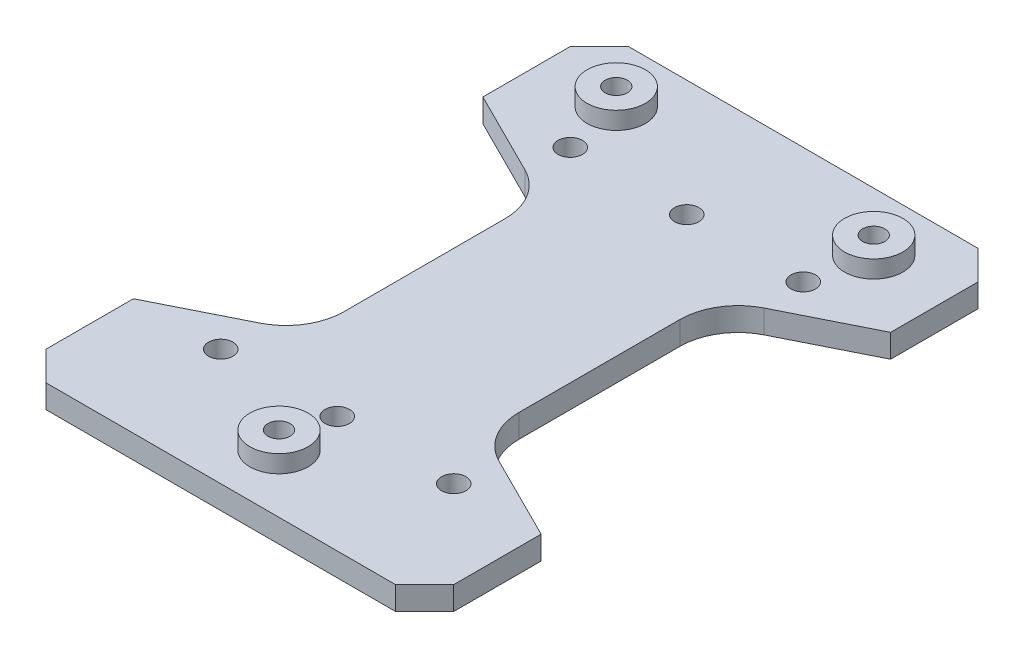
ISO-10303-21;
HEADER;
FILE_DESCRIPTION(('STEP AP214'),'2;1');
FILE_NAME('part.step','',(''),(''),'','','');
FILE_SCHEMA(('AUTOMOTIVE_DESIGN { 1 0 10303 214 1 1 1 1 }'));
ENDSEC;
DATA;
#1=APPLICATION_CONTEXT('core data for automotive mechanical design processes');
#2=APPLICATION_PROTOCOL_DEFINITION('international standard','automotive_design',2000,#1);
#3=PRODUCT_CONTEXT('',#1,'mechanical');
#4=PRODUCT('Part','Part','',(#3));
#5=PRODUCT_RELATED_PRODUCT_CATEGORY('part','',(#4));
#6=PRODUCT_DEFINITION_FORMATION('','',#4);
#7=PRODUCT_DEFINITION_CONTEXT('part definition',#1,'design');
#8=PRODUCT_DEFINITION('design','',#6,#7);
#9=PRODUCT_DEFINITION_SHAPE('','',#8);
#10=(LENGTH_UNIT() NAMED_UNIT(*) SI_UNIT(.MILLI.,.METRE.));
#11=(NAMED_UNIT(*) PLANE_ANGLE_UNIT() SI_UNIT($,.RADIAN.));
#12=(NAMED_UNIT(*) SI_UNIT($,.STERADIAN.) SOLID_ANGLE_UNIT());
#13=UNCERTAINTY_MEASURE_WITH_UNIT(LENGTH_MEASURE(1.E-05),#10,'distance_accuracy_value','');
#14=(GEOMETRIC_REPRESENTATION_CONTEXT(3) GLOBAL_UNCERTAINTY_ASSIGNED_CONTEXT((#13)) GLOBAL_UNIT_ASSIGNED_CONTEXT((#10,
#11,#12)) REPRESENTATION_CONTEXT('',''));
#15=CARTESIAN_POINT('',(0.,0.,0.));
#16=DIRECTION('',(0.,0.,1.));
#17=DIRECTION('',(1.,0.,0.));
#18=AXIS2_PLACEMENT_3D('',#15,#16,#17);
#19=CARTESIAN_POINT('',(35.,4.,-50.));
#20=DIRECTION('',(-1.,0.,0.));
#21=DIRECTION('',(0.,0.,1.));
#22=AXIS2_PLACEMENT_3D('',#19,#20,#21);
#23=PLANE('',#22);
#24=DIRECTION('',(0.,0.,-1.));
#25=VECTOR('',#24,1.);
#26=CARTESIAN_POINT('',(35.,4.,-50.));
#27=LINE('',#26,#25);
#28=CARTESIAN_POINT('',(35.,4.,45.));
#29=VERTEX_POINT('',#28);
#30=CARTESIAN_POINT('',(35.,4.,30.));
#31=VERTEX_POINT('',#30);
#32=EDGE_CURVE('E383',#29,#31,#27,.T.);
#33=ORIENTED_EDGE('',*,*,#32,.F.);
#34=DIRECTION('',(0.,-1.,0.));
#35=VECTOR('',#34,1.);
#36=CARTESIAN_POINT('',(35.,4.,45.));
#37=LINE('',#36,#35);
#38=CARTESIAN_POINT('',(35.,0.,45.));
#39=VERTEX_POINT('',#38);
#40=EDGE_CURVE('E267',#29,#39,#37,.T.);
#41=ORIENTED_EDGE('',*,*,#40,.T.);
#42=DIRECTION('',(0.,0.,-1.));
#43=VECTOR('',#42,1.);
#44=CARTESIAN_POINT('',(35.,0.,-50.));
#45=LINE('',#44,#43);
#46=CARTESIAN_POINT('',(35.,0.,30.));
#47=VERTEX_POINT('',#46);
#48=EDGE_CURVE('E198',#39,#47,#45,.T.);
#49=ORIENTED_EDGE('',*,*,#48,.T.);
#50=DIRECTION('',(0.,1.,0.));
#51=VECTOR('',#50,1.);
#52=CARTESIAN_POINT('',(35.,0.,30.));
#53=LINE('',#52,#51);
#54=EDGE_CURVE('E192',#47,#31,#53,.T.);
#55=ORIENTED_EDGE('',*,*,#54,.T.);
#56=EDGE_LOOP('',(#33,#41,#49,#55));
#57=FACE_BOUND('',#56,.T.);
#58=ADVANCED_FACE('F37',(#57),#23,.F.);
#59=CARTESIAN_POINT('',(35.,0.,-30.));
#60=VERTEX_POINT('',#59);
#61=CARTESIAN_POINT('',(35.,0.,-45.));
#62=VERTEX_POINT('',#61);
#63=EDGE_CURVE('E188',#60,#62,#45,.T.);
#64=ORIENTED_EDGE('',*,*,#63,.T.);
#65=DIRECTION('',(0.,1.,0.));
#66=VECTOR('',#65,1.);
#67=CARTESIAN_POINT('',(35.,4.,-45.));
#68=LINE('',#67,#66);
#69=CARTESIAN_POINT('',(35.,4.,-45.));
#70=VERTEX_POINT('',#69);
#71=EDGE_CURVE('E254',#62,#70,#68,.T.);
#72=ORIENTED_EDGE('',*,*,#71,.T.);
#73=CARTESIAN_POINT('',(35.,4.,-30.));
#74=VERTEX_POINT('',#73);
#75=EDGE_CURVE('E191',#74,#70,#27,.T.);
#76=ORIENTED_EDGE('',*,*,#75,.F.);
#77=DIRECTION('',(0.,1.,0.));
#78=VECTOR('',#77,1.);
#79=CARTESIAN_POINT('',(35.,0.,-30.));
#80=LINE('',#79,#78);
#81=EDGE_CURVE('E177',#60,#74,#80,.T.);
#82=ORIENTED_EDGE('',*,*,#81,.F.);
#83=EDGE_LOOP('',(#64,#72,#76,#82));
#84=FACE_BOUND('',#83,.T.);
#85=ADVANCED_FACE('F187',(#84),#23,.F.);
#86=CARTESIAN_POINT('',(0.,4.,0.));
#87=DIRECTION('',(0.,1.,0.));
#88=DIRECTION('',(0.,0.,1.));
#89=AXIS2_PLACEMENT_3D('',#86,#87,#88);
#90=PLANE('',#89);
#91=CARTESIAN_POINT('',(0.,4.,-30.));
#92=DIRECTION('',(0.,1.,0.));
#93=DIRECTION('',(0.,0.,1.));
#94=AXIS2_PLACEMENT_3D('',#91,#92,#93);
#95=CIRCLE('',#94,2.1);
#96=CARTESIAN_POINT('',(0.,4.,-27.9));
#97=VERTEX_POINT('',#96);
#98=EDGE_CURVE('E342',#97,#97,#95,.T.);
#99=ORIENTED_EDGE('',*,*,#98,.F.);
#100=EDGE_LOOP('',(#99));
#101=FACE_BOUND('',#100,.T.);
#102=CARTESIAN_POINT('',(-20.,4.,-30.));
#103=DIRECTION('',(0.,1.,0.));
#104=DIRECTION('',(0.,0.,1.));
#105=AXIS2_PLACEMENT_3D('',#102,#103,#104);
#106=CIRCLE('',#105,2.1);
#107=CARTESIAN_POINT('',(-20.,4.,-27.9));
#108=VERTEX_POINT('',#107);
#109=EDGE_CURVE('E345',#108,#108,#106,.T.);
#110=ORIENTED_EDGE('',*,*,#109,.F.);
#111=EDGE_LOOP('',(#110));
#112=FACE_BOUND('',#111,.T.);
#113=CARTESIAN_POINT('',(0.,4.,40.));
#114=DIRECTION('',(0.,1.,0.));
#115=DIRECTION('',(0.,0.,1.));
#116=AXIS2_PLACEMENT_3D('',#113,#114,#115);
#117=CIRCLE('',#116,5.);
#118=CARTESIAN_POINT('',(0.,4.,45.));
#119=VERTEX_POINT('',#118);
#120=EDGE_CURVE('E355',#119,#119,#117,.T.);
#121=ORIENTED_EDGE('',*,*,#120,.F.);
#122=EDGE_LOOP('',(#121));
#123=FACE_BOUND('',#122,.T.);
#124=CARTESIAN_POINT('',(22.1,4.,-40.));
#125=DIRECTION('',(0.,1.,0.));
#126=DIRECTION('',(0.,0.,1.));
#127=AXIS2_PLACEMENT_3D('',#124,#125,#126);
#128=CIRCLE('',#127,5.);
#129=CARTESIAN_POINT('',(22.1,4.,-35.));
#130=VERTEX_POINT('',#129);
#131=EDGE_CURVE('E373',#130,#130,#128,.T.);
#132=ORIENTED_EDGE('',*,*,#131,.F.);
#133=EDGE_LOOP('',(#132));
#134=FACE_BOUND('',#133,.T.);
#135=CARTESIAN_POINT('',(-22.1,4.,-40.));
#136=DIRECTION('',(0.,1.,0.));
#137=DIRECTION('',(0.,0.,1.));
#138=AXIS2_PLACEMENT_3D('',#135,#136,#137);
#139=CIRCLE('',#138,5.);
#140=CARTESIAN_POINT('',(-22.1,4.,-35.));
#141=VERTEX_POINT('',#140);
#142=EDGE_CURVE('E203',#141,#141,#139,.T.);
#143=ORIENTED_EDGE('',*,*,#142,.F.);
#144=EDGE_LOOP('',(#143));
#145=FACE_BOUND('',#144,.T.);
#146=CARTESIAN_POINT('',(20.,4.,-30.));
#147=DIRECTION('',(0.,1.,0.));
#148=DIRECTION('',(0.,0.,1.));
#149=AXIS2_PLACEMENT_3D('',#146,#147,#148);
#150=CIRCLE('',#149,2.1);
#151=CARTESIAN_POINT('',(20.,4.,-27.9));
#152=VERTEX_POINT('',#151);
#153=EDGE_CURVE('E221',#152,#152,#150,.T.);
#154=ORIENTED_EDGE('',*,*,#153,.F.);
#155=EDGE_LOOP('',(#154));
#156=FACE_BOUND('',#155,.T.);
#157=CARTESIAN_POINT('',(-20.,4.,30.));
#158=DIRECTION('',(0.,1.,0.));
#159=DIRECTION('',(0.,0.,1.));
#160=AXIS2_PLACEMENT_3D('',#157,#158,#159);
#161=CIRCLE('',#160,2.1);
#162=CARTESIAN_POINT('',(-20.,4.,32.1));
#163=VERTEX_POINT('',#162);
#164=EDGE_CURVE('E227',#163,#163,#161,.T.);
#165=ORIENTED_EDGE('',*,*,#164,.F.);
#166=EDGE_LOOP('',(#165));
#167=FACE_BOUND('',#166,.T.);
#168=CARTESIAN_POINT('',(0.,4.,30.));
#169=DIRECTION('',(0.,1.,0.));
#170=DIRECTION('',(0.,0.,1.));
#171=AXIS2_PLACEMENT_3D('',#168,#169,#170);
#172=CIRCLE('',#171,2.1);
#173=CARTESIAN_POINT('',(0.,4.,32.1));
#174=VERTEX_POINT('',#173);
#175=EDGE_CURVE('E233',#174,#174,#172,.T.);
#176=ORIENTED_EDGE('',*,*,#175,.F.);
#177=EDGE_LOOP('',(#176));
#178=FACE_BOUND('',#177,.T.);
#179=CARTESIAN_POINT('',(20.,4.,30.));
#180=DIRECTION('',(0.,1.,0.));
#181=DIRECTION('',(0.,0.,1.));
#182=AXIS2_PLACEMENT_3D('',#179,#180,#181);
#183=CIRCLE('',#182,2.1);
#184=CARTESIAN_POINT('',(20.,4.,32.1));
#185=VERTEX_POINT('',#184);
#186=EDGE_CURVE('E239',#185,#185,#183,.T.);
#187=ORIENTED_EDGE('',*,*,#186,.F.);
#188=EDGE_LOOP('',(#187));
#189=FACE_BOUND('',#188,.T.);
#190=ORIENTED_EDGE('',*,*,#75,.T.);
#191=DIRECTION('',(0.707106781186547,0.,0.707106781186549));
#192=VECTOR('',#191,1.);
#193=CARTESIAN_POINT('',(40.,4.,-39.9999999999999));
#194=LINE('',#193,#192);
#195=CARTESIAN_POINT('',(30.,4.,-50.));
#196=VERTEX_POINT('',#195);
#197=EDGE_CURVE('E262',#70,#196,#194,.F.);
#198=ORIENTED_EDGE('',*,*,#197,.T.);
#199=DIRECTION('',(-1.,0.,0.));
#200=VECTOR('',#199,1.);
#201=CARTESIAN_POINT('',(-35.,4.,-50.));
#202=LINE('',#201,#200);
#203=CARTESIAN_POINT('',(-30.,4.,-50.));
#204=VERTEX_POINT('',#203);
#205=EDGE_CURVE('E385',#196,#204,#202,.T.);
#206=ORIENTED_EDGE('',*,*,#205,.T.);
#207=DIRECTION('',(0.70710678118655,0.,-0.707106781186546));
#208=VECTOR('',#207,1.);
#209=CARTESIAN_POINT('',(-39.9999999999999,4.,-40.0000000000001));
#210=LINE('',#209,#208);
#211=CARTESIAN_POINT('',(-35.,4.,-45.));
#212=VERTEX_POINT('',#211);
#213=EDGE_CURVE('E260',#204,#212,#210,.F.);
#214=ORIENTED_EDGE('',*,*,#213,.T.);
#215=DIRECTION('',(0.,0.,1.));
#216=VECTOR('',#215,1.);
#217=CARTESIAN_POINT('',(-35.,4.,-50.));
#218=LINE('',#217,#216);
#219=CARTESIAN_POINT('',(-35.,4.,-30.));
#220=VERTEX_POINT('',#219);
#221=EDGE_CURVE('E388',#212,#220,#218,.T.);
#222=ORIENTED_EDGE('',*,*,#221,.T.);
#223=DIRECTION('',(-0.894427190999916,0.,-0.447213595499958));
#224=VECTOR('',#223,1.);
#225=CARTESIAN_POINT('',(5.,4.,-10.));
#226=LINE('',#225,#224);
#227=CARTESIAN_POINT('',(-20.5278640450004,4.,-22.7639320225002));
#228=VERTEX_POINT('',#227);
#229=EDGE_CURVE('E313',#228,#220,#226,.T.);
#230=ORIENTED_EDGE('',*,*,#229,.F.);
#231=CARTESIAN_POINT('',(-25.,4.,-13.819660112501));
#232=DIRECTION('',(0.,1.,0.));
#233=DIRECTION('',(0.,0.,1.));
#234=AXIS2_PLACEMENT_3D('',#231,#232,#233);
#235=CIRCLE('',#234,10.);
#236=CARTESIAN_POINT('',(-15.,4.,-13.819660112501));
#237=VERTEX_POINT('',#236);
#238=EDGE_CURVE('E45',#228,#237,#235,.F.);
#239=ORIENTED_EDGE('',*,*,#238,.T.);
#240=DIRECTION('',(0.,0.,-1.));
#241=VECTOR('',#240,1.);
#242=CARTESIAN_POINT('',(-15.,4.,0.));
#243=LINE('',#242,#241);
#244=CARTESIAN_POINT('',(-15.,4.,13.819660112501));
#245=VERTEX_POINT('',#244);
#246=EDGE_CURVE('E311',#245,#237,#243,.T.);
#247=ORIENTED_EDGE('',*,*,#246,.F.);
#248=CARTESIAN_POINT('',(-25.,4.,13.819660112501));
#249=DIRECTION('',(0.,1.,0.));
#250=DIRECTION('',(0.,0.,1.));
#251=AXIS2_PLACEMENT_3D('',#248,#249,#250);
#252=CIRCLE('',#251,10.);
#253=CARTESIAN_POINT('',(-20.5278640450004,4.,22.7639320225002));
#254=VERTEX_POINT('',#253);
#255=EDGE_CURVE('E303',#245,#254,#252,.F.);
#256=ORIENTED_EDGE('',*,*,#255,.T.);
#257=DIRECTION('',(0.894427190999916,0.,-0.447213595499958));
#258=VECTOR('',#257,1.);
#259=CARTESIAN_POINT('',(5.,4.,10.));
#260=LINE('',#259,#258);
#261=CARTESIAN_POINT('',(-35.,4.,30.));
#262=VERTEX_POINT('',#261);
#263=EDGE_CURVE('E318',#262,#254,#260,.T.);
#264=ORIENTED_EDGE('',*,*,#263,.F.);
#265=CARTESIAN_POINT('',(-35.,4.,45.));
#266=VERTEX_POINT('',#265);
#267=EDGE_CURVE('E387',#262,#266,#218,.T.);
#268=ORIENTED_EDGE('',*,*,#267,.T.);
#269=DIRECTION('',(-0.707106781186546,0.,-0.707106781186549));
#270=VECTOR('',#269,1.);
#271=CARTESIAN_POINT('',(-40.0000000000001,4.,39.9999999999999));
#272=LINE('',#271,#270);
#273=CARTESIAN_POINT('',(-30.,4.,50.));
#274=VERTEX_POINT('',#273);
#275=EDGE_CURVE('E256',#266,#274,#272,.F.);
#276=ORIENTED_EDGE('',*,*,#275,.T.);
#277=DIRECTION('',(1.,0.,0.));
#278=VECTOR('',#277,1.);
#279=CARTESIAN_POINT('',(-35.,4.,50.));
#280=LINE('',#279,#278);
#281=CARTESIAN_POINT('',(30.,4.,50.));
#282=VERTEX_POINT('',#281);
#283=EDGE_CURVE('E207',#274,#282,#280,.T.);
#284=ORIENTED_EDGE('',*,*,#283,.T.);
#285=DIRECTION('',(-0.707106781186549,0.,0.707106781186546));
#286=VECTOR('',#285,1.);
#287=CARTESIAN_POINT('',(39.9999999999999,4.,40.0000000000001));
#288=LINE('',#287,#286);
#289=EDGE_CURVE('E258',#282,#29,#288,.F.);
#290=ORIENTED_EDGE('',*,*,#289,.T.);
#291=ORIENTED_EDGE('',*,*,#32,.T.);
#292=DIRECTION('',(-0.894427190999916,0.,-0.447213595499958));
#293=VECTOR('',#292,1.);
#294=CARTESIAN_POINT('',(-5.,4.,10.));
#295=LINE('',#294,#293);
#296=CARTESIAN_POINT('',(20.5278640450004,4.,22.7639320225002));
#297=VERTEX_POINT('',#296);
#298=EDGE_CURVE('E420',#31,#297,#295,.T.);
#299=ORIENTED_EDGE('',*,*,#298,.T.);
#300=CARTESIAN_POINT('',(25.,4.,13.8196601125011));
#301=DIRECTION('',(0.,1.,0.));
#302=DIRECTION('',(0.,0.,1.));
#303=AXIS2_PLACEMENT_3D('',#300,#301,#302);
#304=CIRCLE('',#303,10.);
#305=CARTESIAN_POINT('',(15.,4.,13.8196601125011));
#306=VERTEX_POINT('',#305);
#307=EDGE_CURVE('E299',#297,#306,#304,.F.);
#308=ORIENTED_EDGE('',*,*,#307,.T.);
#309=DIRECTION('',(0.,0.,-1.));
#310=VECTOR('',#309,1.);
#311=CARTESIAN_POINT('',(15.,4.,0.));
#312=LINE('',#311,#310);
#313=CARTESIAN_POINT('',(15.,4.,-13.819660112501));
#314=VERTEX_POINT('',#313);
#315=EDGE_CURVE('E425',#306,#314,#312,.T.);
#316=ORIENTED_EDGE('',*,*,#315,.T.);
#317=CARTESIAN_POINT('',(25.,4.,-13.819660112501));
#318=DIRECTION('',(0.,1.,0.));
#319=DIRECTION('',(0.,0.,1.));
#320=AXIS2_PLACEMENT_3D('',#317,#318,#319);
#321=CIRCLE('',#320,10.);
#322=CARTESIAN_POINT('',(20.5278640450004,4.,-22.7639320225002));
#323=VERTEX_POINT('',#322);
#324=EDGE_CURVE('E295',#314,#323,#321,.F.);
#325=ORIENTED_EDGE('',*,*,#324,.T.);
#326=DIRECTION('',(0.894427190999916,0.,-0.447213595499958));
#327=VECTOR('',#326,1.);
#328=CARTESIAN_POINT('',(-5.,4.,-10.));
#329=LINE('',#328,#327);
#330=EDGE_CURVE('E429',#323,#74,#329,.T.);
#331=ORIENTED_EDGE('',*,*,#330,.T.);
#332=EDGE_LOOP('',(#190,#198,#206,#214,#222,#230,#239,#247,#256,#264,#268,#276,#284,#290,#291,
#299,#308,#316,#325,#331));
#333=FACE_BOUND('',#332,.T.);
#334=ADVANCED_FACE('F310',(#101,#112,#123,#134,#145,#156,#167,#178,#189,#333),#90,.T.);
#335=CARTESIAN_POINT('',(0.,0.,0.));
#336=DIRECTION('',(0.,1.,0.));
#337=DIRECTION('',(0.,0.,1.));
#338=AXIS2_PLACEMENT_3D('',#335,#336,#337);
#339=PLANE('',#338);
#340=CARTESIAN_POINT('',(20.,0.,30.));
#341=DIRECTION('',(0.,1.,0.));
#342=DIRECTION('',(0.,0.,1.));
#343=AXIS2_PLACEMENT_3D('',#340,#341,#342);
#344=CIRCLE('',#343,2.1);
#345=CARTESIAN_POINT('',(20.,0.,32.1));
#346=VERTEX_POINT('',#345);
#347=EDGE_CURVE('E236',#346,#346,#344,.T.);
#348=ORIENTED_EDGE('',*,*,#347,.T.);
#349=EDGE_LOOP('',(#348));
#350=FACE_BOUND('',#349,.T.);
#351=CARTESIAN_POINT('',(0.,0.,30.));
#352=DIRECTION('',(0.,1.,0.));
#353=DIRECTION('',(0.,0.,1.));
#354=AXIS2_PLACEMENT_3D('',#351,#352,#353);
#355=CIRCLE('',#354,2.1);
#356=CARTESIAN_POINT('',(0.,0.,32.1));
#357=VERTEX_POINT('',#356);
#358=EDGE_CURVE('E230',#357,#357,#355,.T.);
#359=ORIENTED_EDGE('',*,*,#358,.T.);
#360=EDGE_LOOP('',(#359));
#361=FACE_BOUND('',#360,.T.);
#362=CARTESIAN_POINT('',(-20.,0.,30.));
#363=DIRECTION('',(0.,1.,0.));
#364=DIRECTION('',(0.,0.,1.));
#365=AXIS2_PLACEMENT_3D('',#362,#363,#364);
#366=CIRCLE('',#365,2.1);
#367=CARTESIAN_POINT('',(-20.,0.,32.1));
#368=VERTEX_POINT('',#367);
#369=EDGE_CURVE('E224',#368,#368,#366,.T.);
#370=ORIENTED_EDGE('',*,*,#369,.T.);
#371=EDGE_LOOP('',(#370));
#372=FACE_BOUND('',#371,.T.);
#373=CARTESIAN_POINT('',(20.,0.,-30.));
#374=DIRECTION('',(0.,1.,0.));
#375=DIRECTION('',(0.,0.,1.));
#376=AXIS2_PLACEMENT_3D('',#373,#374,#375);
#377=CIRCLE('',#376,2.1);
#378=CARTESIAN_POINT('',(20.,0.,-27.9));
#379=VERTEX_POINT('',#378);
#380=EDGE_CURVE('E218',#379,#379,#377,.T.);
#381=ORIENTED_EDGE('',*,*,#380,.T.);
#382=EDGE_LOOP('',(#381));
#383=FACE_BOUND('',#382,.T.);
#384=CARTESIAN_POINT('',(-20.,0.,-30.));
#385=DIRECTION('',(0.,1.,0.));
#386=DIRECTION('',(0.,0.,1.));
#387=AXIS2_PLACEMENT_3D('',#384,#385,#386);
#388=CIRCLE('',#387,2.1);
#389=CARTESIAN_POINT('',(-20.,0.,-27.9));
#390=VERTEX_POINT('',#389);
#391=EDGE_CURVE('E346',#390,#390,#388,.T.);
#392=ORIENTED_EDGE('',*,*,#391,.T.);
#393=EDGE_LOOP('',(#392));
#394=FACE_BOUND('',#393,.T.);
#395=CARTESIAN_POINT('',(0.,0.,-30.));
#396=DIRECTION('',(0.,1.,0.));
#397=DIRECTION('',(0.,0.,1.));
#398=AXIS2_PLACEMENT_3D('',#395,#396,#397);
#399=CIRCLE('',#398,2.1);
#400=CARTESIAN_POINT('',(0.,0.,-27.9));
#401=VERTEX_POINT('',#400);
#402=EDGE_CURVE('E339',#401,#401,#399,.T.);
#403=ORIENTED_EDGE('',*,*,#402,.T.);
#404=EDGE_LOOP('',(#403));
#405=FACE_BOUND('',#404,.T.);
#406=DIRECTION('',(-1.,0.,0.));
#407=VECTOR('',#406,1.);
#408=CARTESIAN_POINT('',(-35.,0.,-50.));
#409=LINE('',#408,#407);
#410=CARTESIAN_POINT('',(30.,0.,-50.));
#411=VERTEX_POINT('',#410);
#412=CARTESIAN_POINT('',(-30.,0.,-50.));
#413=VERTEX_POINT('',#412);
#414=EDGE_CURVE('E201',#411,#413,#409,.T.);
#415=ORIENTED_EDGE('',*,*,#414,.F.);
#416=DIRECTION('',(-0.707106781186547,0.,-0.707106781186549));
#417=VECTOR('',#416,1.);
#418=CARTESIAN_POINT('',(30.,0.,-50.));
#419=LINE('',#418,#417);
#420=EDGE_CURVE('E197',#411,#62,#419,.F.);
#421=ORIENTED_EDGE('',*,*,#420,.T.);
#422=ORIENTED_EDGE('',*,*,#63,.F.);
#423=DIRECTION('',(0.894427190999916,0.,-0.447213595499958));
#424=VECTOR('',#423,1.);
#425=CARTESIAN_POINT('',(35.,0.,-30.));
#426=LINE('',#425,#424);
#427=CARTESIAN_POINT('',(20.5278640450004,0.,-22.7639320225002));
#428=VERTEX_POINT('',#427);
#429=EDGE_CURVE('E173',#428,#60,#426,.T.);
#430=ORIENTED_EDGE('',*,*,#429,.F.);
#431=CARTESIAN_POINT('',(25.,0.,-13.819660112501));
#432=DIRECTION('',(0.,1.,0.));
#433=DIRECTION('',(0.,0.,1.));
#434=AXIS2_PLACEMENT_3D('',#431,#432,#433);
#435=CIRCLE('',#434,10.);
#436=CARTESIAN_POINT('',(15.,0.,-13.819660112501));
#437=VERTEX_POINT('',#436);
#438=EDGE_CURVE('E297',#428,#437,#435,.T.);
#439=ORIENTED_EDGE('',*,*,#438,.T.);
#440=DIRECTION('',(0.,0.,-1.));
#441=VECTOR('',#440,1.);
#442=CARTESIAN_POINT('',(15.,0.,-20.));
#443=LINE('',#442,#441);
#444=CARTESIAN_POINT('',(15.,0.,13.8196601125011));
#445=VERTEX_POINT('',#444);
#446=EDGE_CURVE('E183',#445,#437,#443,.T.);
#447=ORIENTED_EDGE('',*,*,#446,.F.);
#448=CARTESIAN_POINT('',(25.,0.,13.8196601125011));
#449=DIRECTION('',(0.,1.,0.));
#450=DIRECTION('',(0.,0.,1.));
#451=AXIS2_PLACEMENT_3D('',#448,#449,#450);
#452=CIRCLE('',#451,10.);
#453=CARTESIAN_POINT('',(20.5278640450004,0.,22.7639320225002));
#454=VERTEX_POINT('',#453);
#455=EDGE_CURVE('E301',#445,#454,#452,.T.);
#456=ORIENTED_EDGE('',*,*,#455,.T.);
#457=DIRECTION('',(-0.894427190999916,0.,-0.447213595499958));
#458=VECTOR('',#457,1.);
#459=CARTESIAN_POINT('',(15.,0.,20.));
#460=LINE('',#459,#458);
#461=EDGE_CURVE('E193',#47,#454,#460,.T.);
#462=ORIENTED_EDGE('',*,*,#461,.F.);
#463=ORIENTED_EDGE('',*,*,#48,.F.);
#464=DIRECTION('',(0.707106781186549,0.,-0.707106781186546));
#465=VECTOR('',#464,1.);
#466=CARTESIAN_POINT('',(35.,0.,45.));
#467=LINE('',#466,#465);
#468=CARTESIAN_POINT('',(30.,0.,50.));
#469=VERTEX_POINT('',#468);
#470=EDGE_CURVE('E249',#39,#469,#467,.F.);
#471=ORIENTED_EDGE('',*,*,#470,.T.);
#472=DIRECTION('',(1.,0.,0.));
#473=VECTOR('',#472,1.);
#474=CARTESIAN_POINT('',(-35.,0.,50.));
#475=LINE('',#474,#473);
#476=CARTESIAN_POINT('',(-30.,0.,50.));
#477=VERTEX_POINT('',#476);
#478=EDGE_CURVE('E215',#477,#469,#475,.T.);
#479=ORIENTED_EDGE('',*,*,#478,.F.);
#480=DIRECTION('',(0.707106781186546,0.,0.707106781186549));
#481=VECTOR('',#480,1.);
#482=CARTESIAN_POINT('',(-30.,0.,50.));
#483=LINE('',#482,#481);
#484=CARTESIAN_POINT('',(-35.,0.,45.));
#485=VERTEX_POINT('',#484);
#486=EDGE_CURVE('E247',#477,#485,#483,.F.);
#487=ORIENTED_EDGE('',*,*,#486,.T.);
#488=DIRECTION('',(0.,0.,1.));
#489=VECTOR('',#488,1.);
#490=CARTESIAN_POINT('',(-35.,0.,-50.));
#491=LINE('',#490,#489);
#492=CARTESIAN_POINT('',(-35.,0.,30.));
#493=VERTEX_POINT('',#492);
#494=EDGE_CURVE('E211',#493,#485,#491,.T.);
#495=ORIENTED_EDGE('',*,*,#494,.F.);
#496=DIRECTION('',(0.894427190999916,0.,-0.447213595499958));
#497=VECTOR('',#496,1.);
#498=CARTESIAN_POINT('',(-15.,0.,20.));
#499=LINE('',#498,#497);
#500=CARTESIAN_POINT('',(-20.5278640450004,0.,22.7639320225002));
#501=VERTEX_POINT('',#500);
#502=EDGE_CURVE('E331',#493,#501,#499,.T.);
#503=ORIENTED_EDGE('',*,*,#502,.T.);
#504=CARTESIAN_POINT('',(-25.,0.,13.819660112501));
#505=DIRECTION('',(0.,1.,0.));
#506=DIRECTION('',(0.,0.,1.));
#507=AXIS2_PLACEMENT_3D('',#504,#505,#506);
#508=CIRCLE('',#507,10.);
#509=CARTESIAN_POINT('',(-15.,0.,13.819660112501));
#510=VERTEX_POINT('',#509);
#511=EDGE_CURVE('E305',#501,#510,#508,.T.);
#512=ORIENTED_EDGE('',*,*,#511,.T.);
#513=DIRECTION('',(0.,0.,-1.));
#514=VECTOR('',#513,1.);
#515=CARTESIAN_POINT('',(-15.,0.,-20.));
#516=LINE('',#515,#514);
#517=CARTESIAN_POINT('',(-15.,0.,-13.819660112501));
#518=VERTEX_POINT('',#517);
#519=EDGE_CURVE('E328',#510,#518,#516,.T.);
#520=ORIENTED_EDGE('',*,*,#519,.T.);
#521=CARTESIAN_POINT('',(-25.,0.,-13.819660112501));
#522=DIRECTION('',(0.,1.,0.));
#523=DIRECTION('',(0.,0.,1.));
#524=AXIS2_PLACEMENT_3D('',#521,#522,#523);
#525=CIRCLE('',#524,10.);
#526=CARTESIAN_POINT('',(-20.5278640450004,0.,-22.7639320225002));
#527=VERTEX_POINT('',#526);
#528=EDGE_CURVE('E11',#518,#527,#525,.T.);
#529=ORIENTED_EDGE('',*,*,#528,.T.);
#530=DIRECTION('',(-0.894427190999916,0.,-0.447213595499958));
#531=VECTOR('',#530,1.);
#532=CARTESIAN_POINT('',(-35.,0.,-30.));
#533=LINE('',#532,#531);
#534=CARTESIAN_POINT('',(-35.,0.,-30.));
#535=VERTEX_POINT('',#534);
#536=EDGE_CURVE('E323',#527,#535,#533,.T.);
#537=ORIENTED_EDGE('',*,*,#536,.T.);
#538=CARTESIAN_POINT('',(-35.,0.,-45.));
#539=VERTEX_POINT('',#538);
#540=EDGE_CURVE('E212',#539,#535,#491,.T.);
#541=ORIENTED_EDGE('',*,*,#540,.F.);
#542=DIRECTION('',(-0.70710678118655,0.,0.707106781186546));
#543=VECTOR('',#542,1.);
#544=CARTESIAN_POINT('',(-35.,0.,-45.));
#545=LINE('',#544,#543);
#546=EDGE_CURVE('E251',#539,#413,#545,.F.);
#547=ORIENTED_EDGE('',*,*,#546,.T.);
#548=EDGE_LOOP('',(#415,#421,#422,#430,#439,#447,#456,#462,#463,#471,#479,#487,#495,#503,#512,
#520,#529,#537,#541,#547));
#549=FACE_BOUND('',#548,.T.);
#550=ADVANCED_FACE('F196',(#350,#361,#372,#383,#394,#405,#549),#339,.F.);
#551=CARTESIAN_POINT('',(-35.,4.,-50.));
#552=DIRECTION('',(1.,0.,0.));
#553=DIRECTION('',(0.,0.,-1.));
#554=AXIS2_PLACEMENT_3D('',#551,#552,#553);
#555=PLANE('',#554);
#556=ORIENTED_EDGE('',*,*,#221,.F.);
#557=DIRECTION('',(0.,-1.,0.));
#558=VECTOR('',#557,1.);
#559=CARTESIAN_POINT('',(-35.,4.,-45.));
#560=LINE('',#559,#558);
#561=EDGE_CURVE('E264',#212,#539,#560,.T.);
#562=ORIENTED_EDGE('',*,*,#561,.T.);
#563=ORIENTED_EDGE('',*,*,#540,.T.);
#564=DIRECTION('',(0.,1.,0.));
#565=VECTOR('',#564,1.);
#566=CARTESIAN_POINT('',(-35.,0.,-30.));
#567=LINE('',#566,#565);
#568=EDGE_CURVE('E325',#535,#220,#567,.T.);
#569=ORIENTED_EDGE('',*,*,#568,.T.);
#570=EDGE_LOOP('',(#556,#562,#563,#569));
#571=FACE_BOUND('',#570,.T.);
#572=ADVANCED_FACE('F480',(#571),#555,.F.);
#573=CARTESIAN_POINT('',(20.,0.,30.));
#574=DIRECTION('',(0.,1.,0.));
#575=DIRECTION('',(0.,0.,1.));
#576=AXIS2_PLACEMENT_3D('',#573,#574,#575);
#577=CYLINDRICAL_SURFACE('',#576,2.1);
#578=ORIENTED_EDGE('',*,*,#347,.F.);
#579=EDGE_LOOP('',(#578));
#580=FACE_BOUND('',#579,.T.);
#581=ORIENTED_EDGE('',*,*,#186,.T.);
#582=EDGE_LOOP('',(#581));
#583=FACE_BOUND('',#582,.T.);
#584=ADVANCED_FACE('F476',(#580,#583),#577,.F.);
#585=CARTESIAN_POINT('',(0.,0.,30.));
#586=DIRECTION('',(0.,1.,0.));
#587=DIRECTION('',(0.,0.,1.));
#588=AXIS2_PLACEMENT_3D('',#585,#586,#587);
#589=CYLINDRICAL_SURFACE('',#588,2.1);
#590=ORIENTED_EDGE('',*,*,#358,.F.);
#591=EDGE_LOOP('',(#590));
#592=FACE_BOUND('',#591,.T.);
#593=ORIENTED_EDGE('',*,*,#175,.T.);
#594=EDGE_LOOP('',(#593));
#595=FACE_BOUND('',#594,.T.);
#596=ADVANCED_FACE('F472',(#592,#595),#589,.F.);
#597=CARTESIAN_POINT('',(-20.,0.,30.));
#598=DIRECTION('',(0.,1.,0.));
#599=DIRECTION('',(0.,0.,1.));
#600=AXIS2_PLACEMENT_3D('',#597,#598,#599);
#601=CYLINDRICAL_SURFACE('',#600,2.1);
#602=ORIENTED_EDGE('',*,*,#369,.F.);
#603=EDGE_LOOP('',(#602));
#604=FACE_BOUND('',#603,.T.);
#605=ORIENTED_EDGE('',*,*,#164,.T.);
#606=EDGE_LOOP('',(#605));
#607=FACE_BOUND('',#606,.T.);
#608=ADVANCED_FACE('F468',(#604,#607),#601,.F.);
#609=CARTESIAN_POINT('',(20.,0.,-30.));
#610=DIRECTION('',(0.,1.,0.));
#611=DIRECTION('',(0.,0.,1.));
#612=AXIS2_PLACEMENT_3D('',#609,#610,#611);
#613=CYLINDRICAL_SURFACE('',#612,2.1);
#614=ORIENTED_EDGE('',*,*,#380,.F.);
#615=EDGE_LOOP('',(#614));
#616=FACE_BOUND('',#615,.T.);
#617=ORIENTED_EDGE('',*,*,#153,.T.);
#618=EDGE_LOOP('',(#617));
#619=FACE_BOUND('',#618,.T.);
#620=ADVANCED_FACE('F465',(#616,#619),#613,.F.);
#621=CARTESIAN_POINT('',(-35.,4.,-50.));
#622=DIRECTION('',(0.,0.,1.));
#623=DIRECTION('',(1.,0.,0.));
#624=AXIS2_PLACEMENT_3D('',#621,#622,#623);
#625=PLANE('',#624);
#626=ORIENTED_EDGE('',*,*,#205,.F.);
#627=DIRECTION('',(0.,-1.,0.));
#628=VECTOR('',#627,1.);
#629=CARTESIAN_POINT('',(30.,4.,-50.));
#630=LINE('',#629,#628);
#631=EDGE_CURVE('E244',#196,#411,#630,.T.);
#632=ORIENTED_EDGE('',*,*,#631,.T.);
#633=ORIENTED_EDGE('',*,*,#414,.T.);
#634=DIRECTION('',(0.,1.,0.));
#635=VECTOR('',#634,1.);
#636=CARTESIAN_POINT('',(-30.,4.,-50.));
#637=LINE('',#636,#635);
#638=EDGE_CURVE('E242',#413,#204,#637,.T.);
#639=ORIENTED_EDGE('',*,*,#638,.T.);
#640=EDGE_LOOP('',(#626,#632,#633,#639));
#641=FACE_BOUND('',#640,.T.);
#642=ADVANCED_FACE('F463',(#641),#625,.F.);
#643=ORIENTED_EDGE('',*,*,#494,.T.);
#644=DIRECTION('',(0.,1.,0.));
#645=VECTOR('',#644,1.);
#646=CARTESIAN_POINT('',(-35.,4.,45.));
#647=LINE('',#646,#645);
#648=EDGE_CURVE('E275',#485,#266,#647,.T.);
#649=ORIENTED_EDGE('',*,*,#648,.T.);
#650=ORIENTED_EDGE('',*,*,#267,.F.);
#651=DIRECTION('',(0.,1.,0.));
#652=VECTOR('',#651,1.);
#653=CARTESIAN_POINT('',(-35.,0.,30.));
#654=LINE('',#653,#652);
#655=EDGE_CURVE('E327',#493,#262,#654,.T.);
#656=ORIENTED_EDGE('',*,*,#655,.F.);
#657=EDGE_LOOP('',(#643,#649,#650,#656));
#658=FACE_BOUND('',#657,.T.);
#659=ADVANCED_FACE('F608',(#658),#555,.F.);
#660=CARTESIAN_POINT('',(-35.,4.,50.));
#661=DIRECTION('',(0.,0.,-1.));
#662=DIRECTION('',(-1.,0.,0.));
#663=AXIS2_PLACEMENT_3D('',#660,#661,#662);
#664=PLANE('',#663);
#665=ORIENTED_EDGE('',*,*,#478,.T.);
#666=DIRECTION('',(0.,1.,0.));
#667=VECTOR('',#666,1.);
#668=CARTESIAN_POINT('',(30.,4.,50.));
#669=LINE('',#668,#667);
#670=EDGE_CURVE('E273',#469,#282,#669,.T.);
#671=ORIENTED_EDGE('',*,*,#670,.T.);
#672=ORIENTED_EDGE('',*,*,#283,.F.);
#673=DIRECTION('',(0.,-1.,0.));
#674=VECTOR('',#673,1.);
#675=CARTESIAN_POINT('',(-30.,4.,50.));
#676=LINE('',#675,#674);
#677=EDGE_CURVE('E270',#274,#477,#676,.T.);
#678=ORIENTED_EDGE('',*,*,#677,.T.);
#679=EDGE_LOOP('',(#665,#671,#672,#678));
#680=FACE_BOUND('',#679,.T.);
#681=ADVANCED_FACE('F404',(#680),#664,.F.);
#682=CARTESIAN_POINT('',(-22.1,7.,-40.));
#683=DIRECTION('',(0.,-1.,0.));
#684=DIRECTION('',(0.,0.,-1.));
#685=AXIS2_PLACEMENT_3D('',#682,#683,#684);
#686=CYLINDRICAL_SURFACE('',#685,5.);
#687=CARTESIAN_POINT('',(-22.1,7.,-40.));
#688=DIRECTION('',(0.,1.,0.));
#689=DIRECTION('',(0.,0.,1.));
#690=AXIS2_PLACEMENT_3D('',#687,#688,#689);
#691=CIRCLE('',#690,5.);
#692=CARTESIAN_POINT('',(-22.1,7.,-35.));
#693=VERTEX_POINT('',#692);
#694=EDGE_CURVE('E199',#693,#693,#691,.T.);
#695=ORIENTED_EDGE('',*,*,#694,.F.);
#696=EDGE_LOOP('',(#695));
#697=FACE_BOUND('',#696,.T.);
#698=ORIENTED_EDGE('',*,*,#142,.T.);
#699=EDGE_LOOP('',(#698));
#700=FACE_BOUND('',#699,.T.);
#701=ADVANCED_FACE('F632',(#697,#700),#686,.T.);
#702=CARTESIAN_POINT('',(-22.1,7.,-40.));
#703=DIRECTION('',(0.,1.,0.));
#704=DIRECTION('',(0.,0.,1.));
#705=AXIS2_PLACEMENT_3D('',#702,#703,#704);
#706=PLANE('',#705);
#707=CARTESIAN_POINT('',(-22.1,7.,-40.));
#708=DIRECTION('',(0.,1.,0.));
#709=DIRECTION('',(0.,0.,1.));
#710=AXIS2_PLACEMENT_3D('',#707,#708,#709);
#711=CIRCLE('',#710,1.9);
#712=CARTESIAN_POINT('',(-22.1,7.,-38.1));
#713=VERTEX_POINT('',#712);
#714=EDGE_CURVE('E356',#713,#713,#711,.T.);
#715=ORIENTED_EDGE('',*,*,#714,.F.);
#716=EDGE_LOOP('',(#715));
#717=FACE_BOUND('',#716,.T.);
#718=ORIENTED_EDGE('',*,*,#694,.T.);
#719=EDGE_LOOP('',(#718));
#720=FACE_BOUND('',#719,.T.);
#721=ADVANCED_FACE('F658',(#717,#720),#706,.T.);
#722=CARTESIAN_POINT('',(22.1,7.,-40.));
#723=DIRECTION('',(0.,-1.,0.));
#724=DIRECTION('',(0.,0.,-1.));
#725=AXIS2_PLACEMENT_3D('',#722,#723,#724);
#726=CYLINDRICAL_SURFACE('',#725,5.);
#727=CARTESIAN_POINT('',(22.1,7.,-40.));
#728=DIRECTION('',(0.,1.,0.));
#729=DIRECTION('',(0.,0.,1.));
#730=AXIS2_PLACEMENT_3D('',#727,#728,#729);
#731=CIRCLE('',#730,5.);
#732=CARTESIAN_POINT('',(22.1,7.,-35.));
#733=VERTEX_POINT('',#732);
#734=EDGE_CURVE('E376',#733,#733,#731,.T.);
#735=ORIENTED_EDGE('',*,*,#734,.F.);
#736=EDGE_LOOP('',(#735));
#737=FACE_BOUND('',#736,.T.);
#738=ORIENTED_EDGE('',*,*,#131,.T.);
#739=EDGE_LOOP('',(#738));
#740=FACE_BOUND('',#739,.T.);
#741=ADVANCED_FACE('F666',(#737,#740),#726,.T.);
#742=CARTESIAN_POINT('',(22.1,7.,-40.));
#743=DIRECTION('',(0.,1.,0.));
#744=DIRECTION('',(0.,0.,1.));
#745=AXIS2_PLACEMENT_3D('',#742,#743,#744);
#746=PLANE('',#745);
#747=CARTESIAN_POINT('',(22.1,7.,-40.));
#748=DIRECTION('',(0.,1.,0.));
#749=DIRECTION('',(0.,0.,1.));
#750=AXIS2_PLACEMENT_3D('',#747,#748,#749);
#751=CIRCLE('',#750,1.9);
#752=CARTESIAN_POINT('',(22.1,7.,-38.1));
#753=VERTEX_POINT('',#752);
#754=EDGE_CURVE('E362',#753,#753,#751,.T.);
#755=ORIENTED_EDGE('',*,*,#754,.F.);
#756=EDGE_LOOP('',(#755));
#757=FACE_BOUND('',#756,.T.);
#758=ORIENTED_EDGE('',*,*,#734,.T.);
#759=EDGE_LOOP('',(#758));
#760=FACE_BOUND('',#759,.T.);
#761=ADVANCED_FACE('F675',(#757,#760),#746,.T.);
#762=CARTESIAN_POINT('',(0.,7.,40.));
#763=DIRECTION('',(0.,-1.,0.));
#764=DIRECTION('',(0.,0.,-1.));
#765=AXIS2_PLACEMENT_3D('',#762,#763,#764);
#766=CYLINDRICAL_SURFACE('',#765,5.);
#767=CARTESIAN_POINT('',(0.,7.,40.));
#768=DIRECTION('',(0.,1.,0.));
#769=DIRECTION('',(0.,0.,1.));
#770=AXIS2_PLACEMENT_3D('',#767,#768,#769);
#771=CIRCLE('',#770,5.);
#772=CARTESIAN_POINT('',(0.,7.,45.));
#773=VERTEX_POINT('',#772);
#774=EDGE_CURVE('E370',#773,#773,#771,.T.);
#775=ORIENTED_EDGE('',*,*,#774,.F.);
#776=EDGE_LOOP('',(#775));
#777=FACE_BOUND('',#776,.T.);
#778=ORIENTED_EDGE('',*,*,#120,.T.);
#779=EDGE_LOOP('',(#778));
#780=FACE_BOUND('',#779,.T.);
#781=ADVANCED_FACE('F682',(#777,#780),#766,.T.);
#782=CARTESIAN_POINT('',(0.,7.,40.));
#783=DIRECTION('',(0.,1.,0.));
#784=DIRECTION('',(0.,0.,1.));
#785=AXIS2_PLACEMENT_3D('',#782,#783,#784);
#786=PLANE('',#785);
#787=CARTESIAN_POINT('',(0.,7.,40.));
#788=DIRECTION('',(0.,1.,0.));
#789=DIRECTION('',(0.,0.,1.));
#790=AXIS2_PLACEMENT_3D('',#787,#788,#789);
#791=CIRCLE('',#790,1.9);
#792=CARTESIAN_POINT('',(0.,7.,41.9));
#793=VERTEX_POINT('',#792);
#794=EDGE_CURVE('E349',#793,#793,#791,.T.);
#795=ORIENTED_EDGE('',*,*,#794,.F.);
#796=EDGE_LOOP('',(#795));
#797=FACE_BOUND('',#796,.T.);
#798=ORIENTED_EDGE('',*,*,#774,.T.);
#799=EDGE_LOOP('',(#798));
#800=FACE_BOUND('',#799,.T.);
#801=ADVANCED_FACE('F690',(#797,#800),#786,.T.);
#802=CARTESIAN_POINT('',(0.,3.,40.));
#803=DIRECTION('',(0.,1.,0.));
#804=DIRECTION('',(0.,0.,1.));
#805=AXIS2_PLACEMENT_3D('',#802,#803,#804);
#806=CYLINDRICAL_SURFACE('',#805,1.9);
#807=CARTESIAN_POINT('',(0.,3.,40.));
#808=DIRECTION('',(0.,1.,0.));
#809=DIRECTION('',(0.,0.,1.));
#810=AXIS2_PLACEMENT_3D('',#807,#808,#809);
#811=CIRCLE('',#810,1.9);
#812=CARTESIAN_POINT('',(0.,3.,41.9));
#813=VERTEX_POINT('',#812);
#814=EDGE_CURVE('E365',#813,#813,#811,.T.);
#815=ORIENTED_EDGE('',*,*,#814,.F.);
#816=EDGE_LOOP('',(#815));
#817=FACE_BOUND('',#816,.T.);
#818=ORIENTED_EDGE('',*,*,#794,.T.);
#819=EDGE_LOOP('',(#818));
#820=FACE_BOUND('',#819,.T.);
#821=ADVANCED_FACE('F697',(#817,#820),#806,.F.);
#822=CARTESIAN_POINT('',(0.,3.,40.));
#823=DIRECTION('',(0.,1.,0.));
#824=DIRECTION('',(0.,0.,1.));
#825=AXIS2_PLACEMENT_3D('',#822,#823,#824);
#826=PLANE('',#825);
#827=ORIENTED_EDGE('',*,*,#814,.T.);
#828=EDGE_LOOP('',(#827));
#829=FACE_BOUND('',#828,.T.);
#830=ADVANCED_FACE('F705',(#829),#826,.T.);
#831=CARTESIAN_POINT('',(22.1,3.,-40.));
#832=DIRECTION('',(0.,1.,0.));
#833=DIRECTION('',(0.,0.,1.));
#834=AXIS2_PLACEMENT_3D('',#831,#832,#833);
#835=CYLINDRICAL_SURFACE('',#834,1.9);
#836=CARTESIAN_POINT('',(22.1,3.,-40.));
#837=DIRECTION('',(0.,1.,0.));
#838=DIRECTION('',(0.,0.,1.));
#839=AXIS2_PLACEMENT_3D('',#836,#837,#838);
#840=CIRCLE('',#839,1.9);
#841=CARTESIAN_POINT('',(22.1,3.,-38.1));
#842=VERTEX_POINT('',#841);
#843=EDGE_CURVE('E359',#842,#842,#840,.T.);
#844=ORIENTED_EDGE('',*,*,#843,.F.);
#845=EDGE_LOOP('',(#844));
#846=FACE_BOUND('',#845,.T.);
#847=ORIENTED_EDGE('',*,*,#754,.T.);
#848=EDGE_LOOP('',(#847));
#849=FACE_BOUND('',#848,.T.);
#850=ADVANCED_FACE('F713',(#846,#849),#835,.F.);
#851=CARTESIAN_POINT('',(22.1,3.,-40.));
#852=DIRECTION('',(0.,1.,0.));
#853=DIRECTION('',(0.,0.,1.));
#854=AXIS2_PLACEMENT_3D('',#851,#852,#853);
#855=PLANE('',#854);
#856=ORIENTED_EDGE('',*,*,#843,.T.);
#857=EDGE_LOOP('',(#856));
#858=FACE_BOUND('',#857,.T.);
#859=ADVANCED_FACE('F721',(#858),#855,.T.);
#860=CARTESIAN_POINT('',(-22.1,3.,-40.));
#861=DIRECTION('',(0.,1.,0.));
#862=DIRECTION('',(0.,0.,1.));
#863=AXIS2_PLACEMENT_3D('',#860,#861,#862);
#864=CYLINDRICAL_SURFACE('',#863,1.9);
#865=CARTESIAN_POINT('',(-22.1,3.,-40.));
#866=DIRECTION('',(0.,1.,0.));
#867=DIRECTION('',(0.,0.,1.));
#868=AXIS2_PLACEMENT_3D('',#865,#866,#867);
#869=CIRCLE('',#868,1.9);
#870=CARTESIAN_POINT('',(-22.1,3.,-38.1));
#871=VERTEX_POINT('',#870);
#872=EDGE_CURVE('E352',#871,#871,#869,.T.);
#873=ORIENTED_EDGE('',*,*,#872,.F.);
#874=EDGE_LOOP('',(#873));
#875=FACE_BOUND('',#874,.T.);
#876=ORIENTED_EDGE('',*,*,#714,.T.);
#877=EDGE_LOOP('',(#876));
#878=FACE_BOUND('',#877,.T.);
#879=ADVANCED_FACE('F729',(#875,#878),#864,.F.);
#880=CARTESIAN_POINT('',(-22.1,3.,-40.));
#881=DIRECTION('',(0.,1.,0.));
#882=DIRECTION('',(0.,0.,1.));
#883=AXIS2_PLACEMENT_3D('',#880,#881,#882);
#884=PLANE('',#883);
#885=ORIENTED_EDGE('',*,*,#872,.T.);
#886=EDGE_LOOP('',(#885));
#887=FACE_BOUND('',#886,.T.);
#888=ADVANCED_FACE('F737',(#887),#884,.T.);
#889=CARTESIAN_POINT('',(-20.,0.,-30.));
#890=DIRECTION('',(0.,1.,0.));
#891=DIRECTION('',(0.,0.,1.));
#892=AXIS2_PLACEMENT_3D('',#889,#890,#891);
#893=CYLINDRICAL_SURFACE('',#892,2.1);
#894=ORIENTED_EDGE('',*,*,#391,.F.);
#895=EDGE_LOOP('',(#894));
#896=FACE_BOUND('',#895,.T.);
#897=ORIENTED_EDGE('',*,*,#109,.T.);
#898=EDGE_LOOP('',(#897));
#899=FACE_BOUND('',#898,.T.);
#900=ADVANCED_FACE('F745',(#896,#899),#893,.F.);
#901=CARTESIAN_POINT('',(0.,0.,-30.));
#902=DIRECTION('',(0.,1.,0.));
#903=DIRECTION('',(0.,0.,1.));
#904=AXIS2_PLACEMENT_3D('',#901,#902,#903);
#905=CYLINDRICAL_SURFACE('',#904,2.1);
#906=ORIENTED_EDGE('',*,*,#402,.F.);
#907=EDGE_LOOP('',(#906));
#908=FACE_BOUND('',#907,.T.);
#909=ORIENTED_EDGE('',*,*,#98,.T.);
#910=EDGE_LOOP('',(#909));
#911=FACE_BOUND('',#910,.T.);
#912=ADVANCED_FACE('F573',(#908,#911),#905,.F.);
#913=CARTESIAN_POINT('',(-35.,0.,-30.));
#914=DIRECTION('',(0.447213595499958,0.,-0.894427190999916));
#915=DIRECTION('',(-0.894427190999916,0.,-0.447213595499958));
#916=AXIS2_PLACEMENT_3D('',#913,#914,#915);
#917=PLANE('',#916);
#918=ORIENTED_EDGE('',*,*,#536,.F.);
#919=DIRECTION('',(0.,1.,0.));
#920=VECTOR('',#919,1.);
#921=CARTESIAN_POINT('',(-20.5278640450004,4.,-22.7639320225002));
#922=LINE('',#921,#920);
#923=EDGE_CURVE('E293',#527,#228,#922,.T.);
#924=ORIENTED_EDGE('',*,*,#923,.T.);
#925=ORIENTED_EDGE('',*,*,#229,.T.);
#926=ORIENTED_EDGE('',*,*,#568,.F.);
#927=EDGE_LOOP('',(#918,#924,#925,#926));
#928=FACE_BOUND('',#927,.T.);
#929=ADVANCED_FACE('F321',(#928),#917,.F.);
#930=CARTESIAN_POINT('',(-15.,0.,-20.));
#931=DIRECTION('',(1.,0.,0.));
#932=DIRECTION('',(0.,0.,-1.));
#933=AXIS2_PLACEMENT_3D('',#930,#931,#932);
#934=PLANE('',#933);
#935=ORIENTED_EDGE('',*,*,#519,.F.);
#936=DIRECTION('',(0.,1.,0.));
#937=VECTOR('',#936,1.);
#938=CARTESIAN_POINT('',(-15.,4.,13.819660112501));
#939=LINE('',#938,#937);
#940=EDGE_CURVE('E288',#510,#245,#939,.T.);
#941=ORIENTED_EDGE('',*,*,#940,.T.);
#942=ORIENTED_EDGE('',*,*,#246,.T.);
#943=DIRECTION('',(0.,1.,0.));
#944=VECTOR('',#943,1.);
#945=CARTESIAN_POINT('',(-15.,0.,-13.819660112501));
#946=LINE('',#945,#944);
#947=EDGE_CURVE('E286',#237,#518,#946,.F.);
#948=ORIENTED_EDGE('',*,*,#947,.T.);
#949=EDGE_LOOP('',(#935,#941,#942,#948));
#950=FACE_BOUND('',#949,.T.);
#951=ADVANCED_FACE('F316',(#950),#934,.F.);
#952=CARTESIAN_POINT('',(-15.,0.,20.));
#953=DIRECTION('',(0.447213595499958,0.,0.894427190999916));
#954=DIRECTION('',(0.894427190999916,0.,-0.447213595499958));
#955=AXIS2_PLACEMENT_3D('',#952,#953,#954);
#956=PLANE('',#955);
#957=ORIENTED_EDGE('',*,*,#263,.T.);
#958=DIRECTION('',(0.,1.,0.));
#959=VECTOR('',#958,1.);
#960=CARTESIAN_POINT('',(-20.5278640450004,0.,22.7639320225002));
#961=LINE('',#960,#959);
#962=EDGE_CURVE('E291',#254,#501,#961,.F.);
#963=ORIENTED_EDGE('',*,*,#962,.T.);
#964=ORIENTED_EDGE('',*,*,#502,.F.);
#965=ORIENTED_EDGE('',*,*,#655,.T.);
#966=EDGE_LOOP('',(#957,#963,#964,#965));
#967=FACE_BOUND('',#966,.T.);
#968=ADVANCED_FACE('F545',(#967),#956,.F.);
#969=CARTESIAN_POINT('',(15.,0.,20.));
#970=DIRECTION('',(0.447213595499958,0.,-0.894427190999916));
#971=DIRECTION('',(-0.894427190999916,0.,-0.447213595499958));
#972=AXIS2_PLACEMENT_3D('',#969,#970,#971);
#973=PLANE('',#972);
#974=ORIENTED_EDGE('',*,*,#461,.T.);
#975=DIRECTION('',(0.,1.,0.));
#976=VECTOR('',#975,1.);
#977=CARTESIAN_POINT('',(20.5278640450004,4.,22.7639320225002));
#978=LINE('',#977,#976);
#979=EDGE_CURVE('E283',#454,#297,#978,.T.);
#980=ORIENTED_EDGE('',*,*,#979,.T.);
#981=ORIENTED_EDGE('',*,*,#298,.F.);
#982=ORIENTED_EDGE('',*,*,#54,.F.);
#983=EDGE_LOOP('',(#974,#980,#981,#982));
#984=FACE_BOUND('',#983,.T.);
#985=ADVANCED_FACE('F423',(#984),#973,.T.);
#986=CARTESIAN_POINT('',(15.,0.,-20.));
#987=DIRECTION('',(1.,0.,0.));
#988=DIRECTION('',(0.,0.,-1.));
#989=AXIS2_PLACEMENT_3D('',#986,#987,#988);
#990=PLANE('',#989);
#991=ORIENTED_EDGE('',*,*,#446,.T.);
#992=DIRECTION('',(0.,1.,0.));
#993=VECTOR('',#992,1.);
#994=CARTESIAN_POINT('',(15.,4.,-13.819660112501));
#995=LINE('',#994,#993);
#996=EDGE_CURVE('E279',#437,#314,#995,.T.);
#997=ORIENTED_EDGE('',*,*,#996,.T.);
#998=ORIENTED_EDGE('',*,*,#315,.F.);
#999=DIRECTION('',(0.,1.,0.));
#1000=VECTOR('',#999,1.);
#1001=CARTESIAN_POINT('',(15.,0.,13.8196601125011));
#1002=LINE('',#1001,#1000);
#1003=EDGE_CURVE('E277',#306,#445,#1002,.F.);
#1004=ORIENTED_EDGE('',*,*,#1003,.T.);
#1005=EDGE_LOOP('',(#991,#997,#998,#1004));
#1006=FACE_BOUND('',#1005,.T.);
#1007=ADVANCED_FACE('F439',(#1006),#990,.T.);
#1008=CARTESIAN_POINT('',(35.,0.,-30.));
#1009=DIRECTION('',(0.447213595499958,0.,0.894427190999916));
#1010=DIRECTION('',(0.894427190999916,0.,-0.447213595499958));
#1011=AXIS2_PLACEMENT_3D('',#1008,#1009,#1010);
#1012=PLANE('',#1011);
#1013=ORIENTED_EDGE('',*,*,#330,.F.);
#1014=DIRECTION('',(0.,1.,0.));
#1015=VECTOR('',#1014,1.);
#1016=CARTESIAN_POINT('',(20.5278640450004,0.,-22.7639320225002));
#1017=LINE('',#1016,#1015);
#1018=EDGE_CURVE('E180',#323,#428,#1017,.F.);
#1019=ORIENTED_EDGE('',*,*,#1018,.T.);
#1020=ORIENTED_EDGE('',*,*,#429,.T.);
#1021=ORIENTED_EDGE('',*,*,#81,.T.);
#1022=EDGE_LOOP('',(#1013,#1019,#1020,#1021));
#1023=FACE_BOUND('',#1022,.T.);
#1024=ADVANCED_FACE('F176',(#1023),#1012,.T.);
#1025=CARTESIAN_POINT('',(30.,4.,-50.));
#1026=DIRECTION('',(-0.707106781186548,0.,0.707106781186546));
#1027=DIRECTION('',(0.,-1.,0.));
#1028=AXIS2_PLACEMENT_3D('',#1025,#1026,#1027);
#1029=PLANE('',#1028);
#1030=ORIENTED_EDGE('',*,*,#197,.F.);
#1031=ORIENTED_EDGE('',*,*,#71,.F.);
#1032=ORIENTED_EDGE('',*,*,#420,.F.);
#1033=ORIENTED_EDGE('',*,*,#631,.F.);
#1034=EDGE_LOOP('',(#1030,#1031,#1032,#1033));
#1035=FACE_BOUND('',#1034,.T.);
#1036=ADVANCED_FACE('F482',(#1035),#1029,.F.);
#1037=CARTESIAN_POINT('',(-35.,4.,-45.));
#1038=DIRECTION('',(0.707106781186545,0.,0.707106781186549));
#1039=DIRECTION('',(0.,-1.,0.));
#1040=AXIS2_PLACEMENT_3D('',#1037,#1038,#1039);
#1041=PLANE('',#1040);
#1042=ORIENTED_EDGE('',*,*,#213,.F.);
#1043=ORIENTED_EDGE('',*,*,#638,.F.);
#1044=ORIENTED_EDGE('',*,*,#546,.F.);
#1045=ORIENTED_EDGE('',*,*,#561,.F.);
#1046=EDGE_LOOP('',(#1042,#1043,#1044,#1045));
#1047=FACE_BOUND('',#1046,.T.);
#1048=ADVANCED_FACE('F485',(#1047),#1041,.F.);
#1049=CARTESIAN_POINT('',(35.,4.,45.));
#1050=DIRECTION('',(-0.707106781186545,0.,-0.707106781186549));
#1051=DIRECTION('',(0.,-1.,0.));
#1052=AXIS2_PLACEMENT_3D('',#1049,#1050,#1051);
#1053=PLANE('',#1052);
#1054=ORIENTED_EDGE('',*,*,#289,.F.);
#1055=ORIENTED_EDGE('',*,*,#670,.F.);
#1056=ORIENTED_EDGE('',*,*,#470,.F.);
#1057=ORIENTED_EDGE('',*,*,#40,.F.);
#1058=EDGE_LOOP('',(#1054,#1055,#1056,#1057));
#1059=FACE_BOUND('',#1058,.T.);
#1060=ADVANCED_FACE('F413',(#1059),#1053,.F.);
#1061=CARTESIAN_POINT('',(-30.,4.,50.));
#1062=DIRECTION('',(0.707106781186549,0.,-0.707106781186546));
#1063=DIRECTION('',(0.,-1.,0.));
#1064=AXIS2_PLACEMENT_3D('',#1061,#1062,#1063);
#1065=PLANE('',#1064);
#1066=ORIENTED_EDGE('',*,*,#275,.F.);
#1067=ORIENTED_EDGE('',*,*,#648,.F.);
#1068=ORIENTED_EDGE('',*,*,#486,.F.);
#1069=ORIENTED_EDGE('',*,*,#677,.F.);
#1070=EDGE_LOOP('',(#1066,#1067,#1068,#1069));
#1071=FACE_BOUND('',#1070,.T.);
#1072=ADVANCED_FACE('F401',(#1071),#1065,.F.);
#1073=CARTESIAN_POINT('',(25.,0.,-13.819660112501));
#1074=DIRECTION('',(0.,-1.,0.));
#1075=DIRECTION('',(0.,0.,-1.));
#1076=AXIS2_PLACEMENT_3D('',#1073,#1074,#1075);
#1077=CYLINDRICAL_SURFACE('',#1076,10.);
#1078=ORIENTED_EDGE('',*,*,#438,.F.);
#1079=ORIENTED_EDGE('',*,*,#1018,.F.);
#1080=ORIENTED_EDGE('',*,*,#324,.F.);
#1081=ORIENTED_EDGE('',*,*,#996,.F.);
#1082=EDGE_LOOP('',(#1078,#1079,#1080,#1081));
#1083=FACE_BOUND('',#1082,.T.);
#1084=ADVANCED_FACE('F444',(#1083),#1077,.F.);
#1085=CARTESIAN_POINT('',(25.,0.,13.8196601125011));
#1086=DIRECTION('',(0.,-1.,0.));
#1087=DIRECTION('',(0.,0.,-1.));
#1088=AXIS2_PLACEMENT_3D('',#1085,#1086,#1087);
#1089=CYLINDRICAL_SURFACE('',#1088,10.);
#1090=ORIENTED_EDGE('',*,*,#455,.F.);
#1091=ORIENTED_EDGE('',*,*,#1003,.F.);
#1092=ORIENTED_EDGE('',*,*,#307,.F.);
#1093=ORIENTED_EDGE('',*,*,#979,.F.);
#1094=EDGE_LOOP('',(#1090,#1091,#1092,#1093));
#1095=FACE_BOUND('',#1094,.T.);
#1096=ADVANCED_FACE('F446',(#1095),#1089,.F.);
#1097=CARTESIAN_POINT('',(-25.,0.,13.819660112501));
#1098=DIRECTION('',(0.,-1.,0.));
#1099=DIRECTION('',(0.,0.,-1.));
#1100=AXIS2_PLACEMENT_3D('',#1097,#1098,#1099);
#1101=CYLINDRICAL_SURFACE('',#1100,10.);
#1102=ORIENTED_EDGE('',*,*,#511,.F.);
#1103=ORIENTED_EDGE('',*,*,#962,.F.);
#1104=ORIENTED_EDGE('',*,*,#255,.F.);
#1105=ORIENTED_EDGE('',*,*,#940,.F.);
#1106=EDGE_LOOP('',(#1102,#1103,#1104,#1105));
#1107=FACE_BOUND('',#1106,.T.);
#1108=ADVANCED_FACE('F448',(#1107),#1101,.F.);
#1109=CARTESIAN_POINT('',(-25.,0.,-13.819660112501));
#1110=DIRECTION('',(0.,-1.,0.));
#1111=DIRECTION('',(0.,0.,-1.));
#1112=AXIS2_PLACEMENT_3D('',#1109,#1110,#1111);
#1113=CYLINDRICAL_SURFACE('',#1112,10.);
#1114=ORIENTED_EDGE('',*,*,#528,.F.);
#1115=ORIENTED_EDGE('',*,*,#947,.F.);
#1116=ORIENTED_EDGE('',*,*,#238,.F.);
#1117=ORIENTED_EDGE('',*,*,#923,.F.);
#1118=EDGE_LOOP('',(#1114,#1115,#1116,#1117));
#1119=FACE_BOUND('',#1118,.T.);
#1120=ADVANCED_FACE('F39',(#1119),#1113,.F.);
#1121=CLOSED_SHELL('',(#58,#85,#334,#550,#572,#584,#596,#608,#620,#642,#659,#681,#701,#721,#741,
#761,#781,#801,#821,#830,#850,#859,#879,#888,#900,#912,#929,#951,#968,#985,#1007,#1024,#1036,
#1048,#1060,#1072,#1084,#1096,#1108,#1120));
#1122=MANIFOLD_SOLID_BREP('B2',#1121);
#1123=ADVANCED_BREP_SHAPE_REPRESENTATION('',(#18,#1122),#14);
#1124=SHAPE_DEFINITION_REPRESENTATION(#9,#1123);
ENDSEC;
END-ISO-10303-21;
